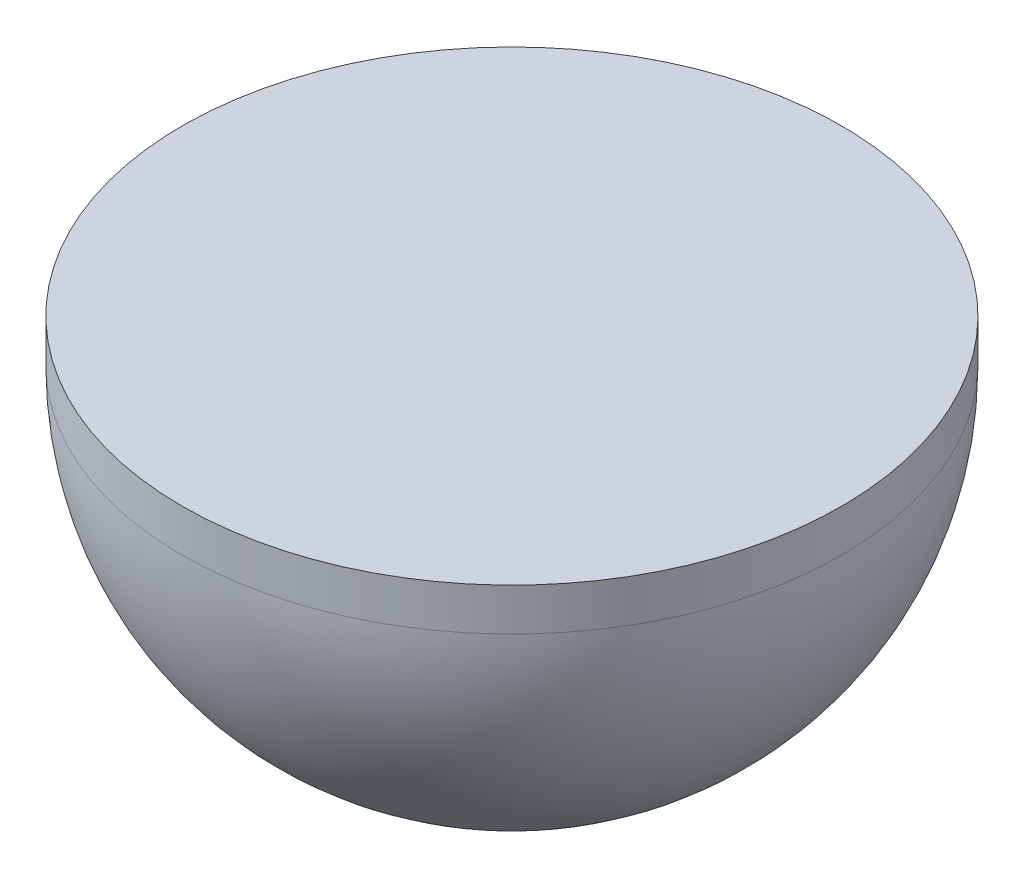
ISO-10303-21;
HEADER;
FILE_DESCRIPTION(('STEP AP214'),'2;1');
FILE_NAME('part.step','',(''),(''),'','','');
FILE_SCHEMA(('AUTOMOTIVE_DESIGN { 1 0 10303 214 1 1 1 1 }'));
ENDSEC;
DATA;
#1=APPLICATION_CONTEXT('core data for automotive mechanical design processes');
#2=APPLICATION_PROTOCOL_DEFINITION('international standard','automotive_design',2000,#1);
#3=PRODUCT_CONTEXT('',#1,'mechanical');
#4=PRODUCT('Part','Part','',(#3));
#5=PRODUCT_RELATED_PRODUCT_CATEGORY('part','',(#4));
#6=PRODUCT_DEFINITION_FORMATION('','',#4);
#7=PRODUCT_DEFINITION_CONTEXT('part definition',#1,'design');
#8=PRODUCT_DEFINITION('design','',#6,#7);
#9=PRODUCT_DEFINITION_SHAPE('','',#8);
#10=(LENGTH_UNIT() NAMED_UNIT(*) SI_UNIT(.MILLI.,.METRE.));
#11=(NAMED_UNIT(*) PLANE_ANGLE_UNIT() SI_UNIT($,.RADIAN.));
#12=(NAMED_UNIT(*) SI_UNIT($,.STERADIAN.) SOLID_ANGLE_UNIT());
#13=UNCERTAINTY_MEASURE_WITH_UNIT(LENGTH_MEASURE(1.E-05),#10,'distance_accuracy_value','');
#14=(GEOMETRIC_REPRESENTATION_CONTEXT(3) GLOBAL_UNCERTAINTY_ASSIGNED_CONTEXT((#13)) GLOBAL_UNIT_ASSIGNED_CONTEXT((#10,
#11,#12)) REPRESENTATION_CONTEXT('',''));
#15=CARTESIAN_POINT('',(0.,0.,0.));
#16=DIRECTION('',(0.,0.,1.));
#17=DIRECTION('',(1.,0.,0.));
#18=AXIS2_PLACEMENT_3D('',#15,#16,#17);
#19=CARTESIAN_POINT('',(0.,0.,0.));
#20=DIRECTION('',(0.,1.,0.));
#21=DIRECTION('',(-1.,0.,0.));
#22=AXIS2_PLACEMENT_3D('',#19,#20,#21);
#23=SPHERICAL_SURFACE('',#22,70.);
#24=CARTESIAN_POINT('',(0.,0.,0.));
#25=DIRECTION('',(0.,1.,0.));
#26=DIRECTION('',(0.,0.,1.));
#27=AXIS2_PLACEMENT_3D('',#24,#25,#26);
#28=CIRCLE('',#27,70.);
#29=CARTESIAN_POINT('',(0.,0.,70.));
#30=VERTEX_POINT('',#29);
#31=EDGE_CURVE('E10',#30,#30,#28,.T.);
#32=ORIENTED_EDGE('',*,*,#31,.F.);
#33=EDGE_LOOP('',(#32));
#34=FACE_BOUND('',#33,.T.);
#35=ADVANCED_FACE('F31',(#34),#23,.T.);
#36=CARTESIAN_POINT('',(0.,31.6977615704559,0.));
#37=DIRECTION('',(0.,1.,0.));
#38=DIRECTION('',(0.,0.,1.));
#39=AXIS2_PLACEMENT_3D('',#36,#37,#38);
#40=CYLINDRICAL_SURFACE('',#39,70.);
#41=ORIENTED_EDGE('',*,*,#31,.T.);
#42=EDGE_LOOP('',(#41));
#43=FACE_BOUND('',#42,.T.);
#44=CARTESIAN_POINT('',(0.,9.,0.));
#45=DIRECTION('',(0.,1.,0.));
#46=DIRECTION('',(0.,0.,1.));
#47=AXIS2_PLACEMENT_3D('',#44,#45,#46);
#48=CIRCLE('',#47,70.);
#49=CARTESIAN_POINT('',(0.,9.,70.));
#50=VERTEX_POINT('',#49);
#51=EDGE_CURVE('E37',#50,#50,#48,.T.);
#52=ORIENTED_EDGE('',*,*,#51,.F.);
#53=EDGE_LOOP('',(#52));
#54=FACE_BOUND('',#53,.T.);
#55=ADVANCED_FACE('F45',(#43,#54),#40,.T.);
#56=CARTESIAN_POINT('',(-70.,9.,0.));
#57=DIRECTION('',(0.,1.,0.));
#58=DIRECTION('',(0.,0.,1.));
#59=AXIS2_PLACEMENT_3D('',#56,#57,#58);
#60=PLANE('',#59);
#61=ORIENTED_EDGE('',*,*,#51,.T.);
#62=EDGE_LOOP('',(#61));
#63=FACE_BOUND('',#62,.T.);
#64=ADVANCED_FACE('F43',(#63),#60,.T.);
#65=CLOSED_SHELL('',(#35,#55,#64));
#66=MANIFOLD_SOLID_BREP('B2',#65);
#67=ADVANCED_BREP_SHAPE_REPRESENTATION('',(#18,#66),#14);
#68=SHAPE_DEFINITION_REPRESENTATION(#9,#67);
ENDSEC;
END-ISO-10303-21;
